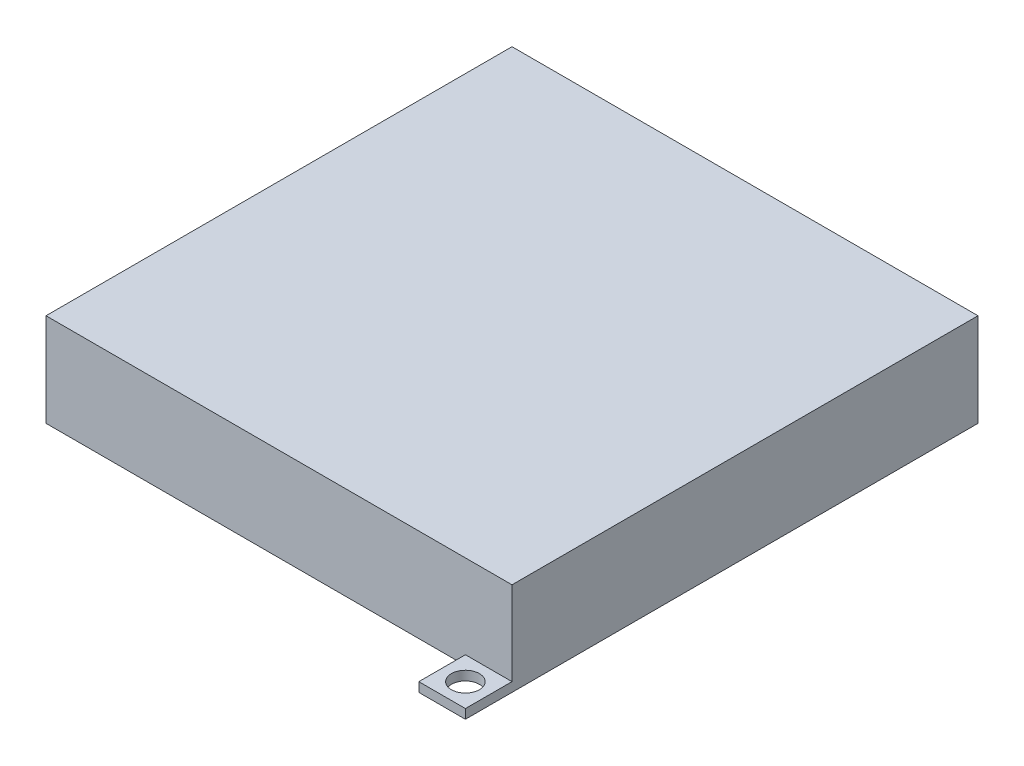
ISO-10303-21;
HEADER;
FILE_DESCRIPTION(('STEP AP214'),'2;1');
FILE_NAME('part.step','',(''),(''),'','','');
FILE_SCHEMA(('AUTOMOTIVE_DESIGN { 1 0 10303 214 1 1 1 1 }'));
ENDSEC;
DATA;
#1=APPLICATION_CONTEXT('core data for automotive mechanical design processes');
#2=APPLICATION_PROTOCOL_DEFINITION('international standard','automotive_design',2000,#1);
#3=PRODUCT_CONTEXT('',#1,'mechanical');
#4=PRODUCT('Part','Part','',(#3));
#5=PRODUCT_RELATED_PRODUCT_CATEGORY('part','',(#4));
#6=PRODUCT_DEFINITION_FORMATION('','',#4);
#7=PRODUCT_DEFINITION_CONTEXT('part definition',#1,'design');
#8=PRODUCT_DEFINITION('design','',#6,#7);
#9=PRODUCT_DEFINITION_SHAPE('','',#8);
#10=(LENGTH_UNIT() NAMED_UNIT(*) SI_UNIT(.MILLI.,.METRE.));
#11=(NAMED_UNIT(*) PLANE_ANGLE_UNIT() SI_UNIT($,.RADIAN.));
#12=(NAMED_UNIT(*) SI_UNIT($,.STERADIAN.) SOLID_ANGLE_UNIT());
#13=UNCERTAINTY_MEASURE_WITH_UNIT(LENGTH_MEASURE(1.E-05),#10,'distance_accuracy_value','');
#14=(GEOMETRIC_REPRESENTATION_CONTEXT(3) GLOBAL_UNCERTAINTY_ASSIGNED_CONTEXT((#13)) GLOBAL_UNIT_ASSIGNED_CONTEXT((#10,
#11,#12)) REPRESENTATION_CONTEXT('',''));
#15=CARTESIAN_POINT('',(0.,0.,0.));
#16=DIRECTION('',(0.,0.,1.));
#17=DIRECTION('',(1.,0.,0.));
#18=AXIS2_PLACEMENT_3D('',#15,#16,#17);
#19=CARTESIAN_POINT('',(25.,10.,25.));
#20=DIRECTION('',(0.,0.,-1.));
#21=DIRECTION('',(-1.,0.,0.));
#22=AXIS2_PLACEMENT_3D('',#19,#20,#21);
#23=PLANE('',#22);
#24=DIRECTION('',(0.,-1.,0.));
#25=VECTOR('',#24,1.);
#26=CARTESIAN_POINT('',(20.,1.,25.));
#27=LINE('',#26,#25);
#28=CARTESIAN_POINT('',(20.,1.,25.));
#29=VERTEX_POINT('',#28);
#30=CARTESIAN_POINT('',(20.,0.,25.));
#31=VERTEX_POINT('',#30);
#32=EDGE_CURVE('E180',#29,#31,#27,.T.);
#33=ORIENTED_EDGE('',*,*,#32,.F.);
#34=DIRECTION('',(1.,0.,0.));
#35=VECTOR('',#34,1.);
#36=CARTESIAN_POINT('',(20.,1.,25.));
#37=LINE('',#36,#35);
#38=CARTESIAN_POINT('',(25.,0.999999999999999,25.));
#39=VERTEX_POINT('',#38);
#40=EDGE_CURVE('E165',#29,#39,#37,.T.);
#41=ORIENTED_EDGE('',*,*,#40,.T.);
#42=DIRECTION('',(0.,-1.,0.));
#43=VECTOR('',#42,1.);
#44=CARTESIAN_POINT('',(25.,10.,25.));
#45=LINE('',#44,#43);
#46=CARTESIAN_POINT('',(25.,10.,25.));
#47=VERTEX_POINT('',#46);
#48=EDGE_CURVE('E163',#47,#39,#45,.T.);
#49=ORIENTED_EDGE('',*,*,#48,.F.);
#50=DIRECTION('',(1.,0.,0.));
#51=VECTOR('',#50,1.);
#52=CARTESIAN_POINT('',(25.,10.,25.));
#53=LINE('',#52,#51);
#54=CARTESIAN_POINT('',(-25.,10.,25.));
#55=VERTEX_POINT('',#54);
#56=EDGE_CURVE('E279',#55,#47,#53,.T.);
#57=ORIENTED_EDGE('',*,*,#56,.F.);
#58=DIRECTION('',(0.,-1.,0.));
#59=VECTOR('',#58,1.);
#60=CARTESIAN_POINT('',(-25.,10.,25.));
#61=LINE('',#60,#59);
#62=CARTESIAN_POINT('',(-25.,0.,25.));
#63=VERTEX_POINT('',#62);
#64=EDGE_CURVE('E296',#55,#63,#61,.T.);
#65=ORIENTED_EDGE('',*,*,#64,.T.);
#66=DIRECTION('',(1.,0.,0.));
#67=VECTOR('',#66,1.);
#68=CARTESIAN_POINT('',(25.,0.,25.));
#69=LINE('',#68,#67);
#70=EDGE_CURVE('E273',#63,#31,#69,.T.);
#71=ORIENTED_EDGE('',*,*,#70,.T.);
#72=EDGE_LOOP('',(#33,#41,#49,#57,#65,#71));
#73=FACE_BOUND('',#72,.T.);
#74=ADVANCED_FACE('F39',(#73),#23,.F.);
#75=CARTESIAN_POINT('',(25.,10.,-25.));
#76=DIRECTION('',(0.,0.,1.));
#77=DIRECTION('',(1.,0.,0.));
#78=AXIS2_PLACEMENT_3D('',#75,#76,#77);
#79=PLANE('',#78);
#80=DIRECTION('',(0.,-1.,0.));
#81=VECTOR('',#80,1.);
#82=CARTESIAN_POINT('',(-20.,1.,-25.));
#83=LINE('',#82,#81);
#84=CARTESIAN_POINT('',(-20.,1.,-25.));
#85=VERTEX_POINT('',#84);
#86=CARTESIAN_POINT('',(-20.,0.,-25.));
#87=VERTEX_POINT('',#86);
#88=EDGE_CURVE('E215',#85,#87,#83,.T.);
#89=ORIENTED_EDGE('',*,*,#88,.F.);
#90=DIRECTION('',(-1.,0.,0.));
#91=VECTOR('',#90,1.);
#92=CARTESIAN_POINT('',(-20.,1.,-25.));
#93=LINE('',#92,#91);
#94=CARTESIAN_POINT('',(-25.,0.999999999999999,-25.));
#95=VERTEX_POINT('',#94);
#96=EDGE_CURVE('E194',#85,#95,#93,.T.);
#97=ORIENTED_EDGE('',*,*,#96,.T.);
#98=DIRECTION('',(0.,-1.,0.));
#99=VECTOR('',#98,1.);
#100=CARTESIAN_POINT('',(-25.,10.,-25.));
#101=LINE('',#100,#99);
#102=CARTESIAN_POINT('',(-25.,10.,-25.));
#103=VERTEX_POINT('',#102);
#104=EDGE_CURVE('E48',#103,#95,#101,.T.);
#105=ORIENTED_EDGE('',*,*,#104,.F.);
#106=DIRECTION('',(-1.,0.,0.));
#107=VECTOR('',#106,1.);
#108=CARTESIAN_POINT('',(25.,10.,-25.));
#109=LINE('',#108,#107);
#110=CARTESIAN_POINT('',(25.,10.,-25.));
#111=VERTEX_POINT('',#110);
#112=EDGE_CURVE('E272',#111,#103,#109,.T.);
#113=ORIENTED_EDGE('',*,*,#112,.F.);
#114=DIRECTION('',(0.,-1.,0.));
#115=VECTOR('',#114,1.);
#116=CARTESIAN_POINT('',(25.,10.,-25.));
#117=LINE('',#116,#115);
#118=CARTESIAN_POINT('',(25.,0.,-25.));
#119=VERTEX_POINT('',#118);
#120=EDGE_CURVE('E11',#111,#119,#117,.T.);
#121=ORIENTED_EDGE('',*,*,#120,.T.);
#122=DIRECTION('',(-1.,0.,0.));
#123=VECTOR('',#122,1.);
#124=CARTESIAN_POINT('',(25.,0.,-25.));
#125=LINE('',#124,#123);
#126=EDGE_CURVE('E284',#119,#87,#125,.T.);
#127=ORIENTED_EDGE('',*,*,#126,.T.);
#128=EDGE_LOOP('',(#89,#97,#105,#113,#121,#127));
#129=FACE_BOUND('',#128,.T.);
#130=ADVANCED_FACE('F308',(#129),#79,.F.);
#131=CARTESIAN_POINT('',(0.,0.,0.));
#132=DIRECTION('',(0.,1.,0.));
#133=DIRECTION('',(0.,0.,1.));
#134=AXIS2_PLACEMENT_3D('',#131,#132,#133);
#135=PLANE('',#134);
#136=DIRECTION('',(0.,0.,-1.));
#137=VECTOR('',#136,1.);
#138=CARTESIAN_POINT('',(25.,0.,25.));
#139=LINE('',#138,#137);
#140=CARTESIAN_POINT('',(25.,0.,30.));
#141=VERTEX_POINT('',#140);
#142=EDGE_CURVE('E267',#141,#119,#139,.T.);
#143=ORIENTED_EDGE('',*,*,#142,.F.);
#144=DIRECTION('',(-1.,0.,0.));
#145=VECTOR('',#144,1.);
#146=CARTESIAN_POINT('',(25.,0.,30.));
#147=LINE('',#146,#145);
#148=CARTESIAN_POINT('',(20.,0.,30.));
#149=VERTEX_POINT('',#148);
#150=EDGE_CURVE('E149',#141,#149,#147,.T.);
#151=ORIENTED_EDGE('',*,*,#150,.T.);
#152=DIRECTION('',(0.,0.,-1.));
#153=VECTOR('',#152,1.);
#154=CARTESIAN_POINT('',(20.,0.,30.));
#155=LINE('',#154,#153);
#156=EDGE_CURVE('E168',#149,#31,#155,.T.);
#157=ORIENTED_EDGE('',*,*,#156,.T.);
#158=ORIENTED_EDGE('',*,*,#70,.F.);
#159=DIRECTION('',(0.,0.,1.));
#160=VECTOR('',#159,1.);
#161=CARTESIAN_POINT('',(-25.,0.,25.));
#162=LINE('',#161,#160);
#163=CARTESIAN_POINT('',(-25.,0.,-30.));
#164=VERTEX_POINT('',#163);
#165=EDGE_CURVE('E288',#164,#63,#162,.T.);
#166=ORIENTED_EDGE('',*,*,#165,.F.);
#167=DIRECTION('',(1.,0.,0.));
#168=VECTOR('',#167,1.);
#169=CARTESIAN_POINT('',(-25.,0.,-30.));
#170=LINE('',#169,#168);
#171=CARTESIAN_POINT('',(-20.,0.,-30.));
#172=VERTEX_POINT('',#171);
#173=EDGE_CURVE('E190',#164,#172,#170,.T.);
#174=ORIENTED_EDGE('',*,*,#173,.T.);
#175=DIRECTION('',(0.,0.,1.));
#176=VECTOR('',#175,1.);
#177=CARTESIAN_POINT('',(-20.,0.,-30.));
#178=LINE('',#177,#176);
#179=EDGE_CURVE('E197',#172,#87,#178,.T.);
#180=ORIENTED_EDGE('',*,*,#179,.T.);
#181=ORIENTED_EDGE('',*,*,#126,.F.);
#182=EDGE_LOOP('',(#143,#151,#157,#158,#166,#174,#180,#181));
#183=FACE_BOUND('',#182,.T.);
#184=DIRECTION('',(0.,0.,1.));
#185=VECTOR('',#184,1.);
#186=CARTESIAN_POINT('',(-20.,0.,20.));
#187=LINE('',#186,#185);
#188=CARTESIAN_POINT('',(-20.,0.,-20.));
#189=VERTEX_POINT('',#188);
#190=CARTESIAN_POINT('',(-20.,0.,20.));
#191=VERTEX_POINT('',#190);
#192=EDGE_CURVE('E218',#189,#191,#187,.T.);
#193=ORIENTED_EDGE('',*,*,#192,.T.);
#194=DIRECTION('',(1.,0.,0.));
#195=VECTOR('',#194,1.);
#196=CARTESIAN_POINT('',(-20.,0.,20.));
#197=LINE('',#196,#195);
#198=CARTESIAN_POINT('',(20.,0.,20.));
#199=VERTEX_POINT('',#198);
#200=EDGE_CURVE('E243',#191,#199,#197,.T.);
#201=ORIENTED_EDGE('',*,*,#200,.T.);
#202=DIRECTION('',(0.,0.,-1.));
#203=VECTOR('',#202,1.);
#204=CARTESIAN_POINT('',(20.,0.,20.));
#205=LINE('',#204,#203);
#206=CARTESIAN_POINT('',(20.,0.,-20.));
#207=VERTEX_POINT('',#206);
#208=EDGE_CURVE('E247',#199,#207,#205,.T.);
#209=ORIENTED_EDGE('',*,*,#208,.T.);
#210=DIRECTION('',(-1.,0.,0.));
#211=VECTOR('',#210,1.);
#212=CARTESIAN_POINT('',(-20.,0.,-20.));
#213=LINE('',#212,#211);
#214=EDGE_CURVE('E230',#207,#189,#213,.T.);
#215=ORIENTED_EDGE('',*,*,#214,.T.);
#216=EDGE_LOOP('',(#193,#201,#209,#215));
#217=FACE_BOUND('',#216,.T.);
#218=CARTESIAN_POINT('',(-22.5,0.,-27.5));
#219=DIRECTION('',(0.,-1.,0.));
#220=DIRECTION('',(0.,0.,-1.));
#221=AXIS2_PLACEMENT_3D('',#218,#219,#220);
#222=CIRCLE('',#221,1.5);
#223=CARTESIAN_POINT('',(-22.5,0.,-29.));
#224=VERTEX_POINT('',#223);
#225=EDGE_CURVE('E183',#224,#224,#222,.T.);
#226=ORIENTED_EDGE('',*,*,#225,.F.);
#227=EDGE_LOOP('',(#226));
#228=FACE_BOUND('',#227,.T.);
#229=CARTESIAN_POINT('',(22.5,0.,27.5));
#230=DIRECTION('',(0.,-1.,0.));
#231=DIRECTION('',(0.,0.,-1.));
#232=AXIS2_PLACEMENT_3D('',#229,#230,#231);
#233=CIRCLE('',#232,1.5);
#234=CARTESIAN_POINT('',(22.5,0.,26.));
#235=VERTEX_POINT('',#234);
#236=EDGE_CURVE('E465',#235,#235,#233,.T.);
#237=ORIENTED_EDGE('',*,*,#236,.F.);
#238=EDGE_LOOP('',(#237));
#239=FACE_BOUND('',#238,.T.);
#240=ADVANCED_FACE('F322',(#183,#217,#228,#239),#135,.F.);
#241=CARTESIAN_POINT('',(25.,10.,25.));
#242=DIRECTION('',(-1.,0.,0.));
#243=DIRECTION('',(0.,0.,1.));
#244=AXIS2_PLACEMENT_3D('',#241,#242,#243);
#245=PLANE('',#244);
#246=ORIENTED_EDGE('',*,*,#142,.T.);
#247=ORIENTED_EDGE('',*,*,#120,.F.);
#248=DIRECTION('',(0.,0.,-1.));
#249=VECTOR('',#248,1.);
#250=CARTESIAN_POINT('',(25.,10.,25.));
#251=LINE('',#250,#249);
#252=EDGE_CURVE('E268',#47,#111,#251,.T.);
#253=ORIENTED_EDGE('',*,*,#252,.F.);
#254=ORIENTED_EDGE('',*,*,#48,.T.);
#255=DIRECTION('',(0.,0.,1.));
#256=VECTOR('',#255,1.);
#257=CARTESIAN_POINT('',(25.,1.,25.));
#258=LINE('',#257,#256);
#259=CARTESIAN_POINT('',(25.,1.,30.));
#260=VERTEX_POINT('',#259);
#261=EDGE_CURVE('E55',#39,#260,#258,.T.);
#262=ORIENTED_EDGE('',*,*,#261,.T.);
#263=DIRECTION('',(0.,-1.,0.));
#264=VECTOR('',#263,1.);
#265=CARTESIAN_POINT('',(25.,1.,30.));
#266=LINE('',#265,#264);
#267=EDGE_CURVE('E144',#260,#141,#266,.T.);
#268=ORIENTED_EDGE('',*,*,#267,.T.);
#269=EDGE_LOOP('',(#246,#247,#253,#254,#262,#268));
#270=FACE_BOUND('',#269,.T.);
#271=ADVANCED_FACE('F41',(#270),#245,.F.);
#272=CARTESIAN_POINT('',(-25.,10.,25.));
#273=DIRECTION('',(1.,0.,0.));
#274=DIRECTION('',(0.,0.,-1.));
#275=AXIS2_PLACEMENT_3D('',#272,#273,#274);
#276=PLANE('',#275);
#277=ORIENTED_EDGE('',*,*,#165,.T.);
#278=ORIENTED_EDGE('',*,*,#64,.F.);
#279=DIRECTION('',(0.,0.,1.));
#280=VECTOR('',#279,1.);
#281=CARTESIAN_POINT('',(-25.,10.,25.));
#282=LINE('',#281,#280);
#283=EDGE_CURVE('E276',#103,#55,#282,.T.);
#284=ORIENTED_EDGE('',*,*,#283,.F.);
#285=ORIENTED_EDGE('',*,*,#104,.T.);
#286=DIRECTION('',(0.,0.,-1.));
#287=VECTOR('',#286,1.);
#288=CARTESIAN_POINT('',(-25.,1.,-25.));
#289=LINE('',#288,#287);
#290=CARTESIAN_POINT('',(-25.,1.,-30.));
#291=VERTEX_POINT('',#290);
#292=EDGE_CURVE('E63',#95,#291,#289,.T.);
#293=ORIENTED_EDGE('',*,*,#292,.T.);
#294=DIRECTION('',(0.,-1.,0.));
#295=VECTOR('',#294,1.);
#296=CARTESIAN_POINT('',(-25.,1.,-30.));
#297=LINE('',#296,#295);
#298=EDGE_CURVE('E208',#291,#164,#297,.T.);
#299=ORIENTED_EDGE('',*,*,#298,.T.);
#300=EDGE_LOOP('',(#277,#278,#284,#285,#293,#299));
#301=FACE_BOUND('',#300,.T.);
#302=ADVANCED_FACE('F304',(#301),#276,.F.);
#303=CARTESIAN_POINT('',(0.,10.,0.));
#304=DIRECTION('',(0.,1.,0.));
#305=DIRECTION('',(0.,0.,1.));
#306=AXIS2_PLACEMENT_3D('',#303,#304,#305);
#307=PLANE('',#306);
#308=ORIENTED_EDGE('',*,*,#252,.T.);
#309=ORIENTED_EDGE('',*,*,#112,.T.);
#310=ORIENTED_EDGE('',*,*,#283,.T.);
#311=ORIENTED_EDGE('',*,*,#56,.T.);
#312=EDGE_LOOP('',(#308,#309,#310,#311));
#313=FACE_BOUND('',#312,.T.);
#314=ADVANCED_FACE('F329',(#313),#307,.T.);
#315=CARTESIAN_POINT('',(-20.,7.,20.));
#316=DIRECTION('',(1.,0.,0.));
#317=DIRECTION('',(0.,0.,-1.));
#318=AXIS2_PLACEMENT_3D('',#315,#316,#317);
#319=PLANE('',#318);
#320=ORIENTED_EDGE('',*,*,#192,.F.);
#321=DIRECTION('',(0.,-1.,0.));
#322=VECTOR('',#321,1.);
#323=CARTESIAN_POINT('',(-20.,7.,-20.));
#324=LINE('',#323,#322);
#325=CARTESIAN_POINT('',(-20.,7.,-20.));
#326=VERTEX_POINT('',#325);
#327=EDGE_CURVE('E239',#326,#189,#324,.T.);
#328=ORIENTED_EDGE('',*,*,#327,.F.);
#329=DIRECTION('',(0.,0.,1.));
#330=VECTOR('',#329,1.);
#331=CARTESIAN_POINT('',(-20.,7.,20.));
#332=LINE('',#331,#330);
#333=CARTESIAN_POINT('',(-20.,7.,20.));
#334=VERTEX_POINT('',#333);
#335=EDGE_CURVE('E225',#326,#334,#332,.T.);
#336=ORIENTED_EDGE('',*,*,#335,.T.);
#337=DIRECTION('',(0.,-1.,0.));
#338=VECTOR('',#337,1.);
#339=CARTESIAN_POINT('',(-20.,7.,20.));
#340=LINE('',#339,#338);
#341=EDGE_CURVE('E263',#334,#191,#340,.T.);
#342=ORIENTED_EDGE('',*,*,#341,.T.);
#343=EDGE_LOOP('',(#320,#328,#336,#342));
#344=FACE_BOUND('',#343,.T.);
#345=ADVANCED_FACE('F331',(#344),#319,.T.);
#346=CARTESIAN_POINT('',(-20.,7.,20.));
#347=DIRECTION('',(0.,0.,-1.));
#348=DIRECTION('',(-1.,0.,0.));
#349=AXIS2_PLACEMENT_3D('',#346,#347,#348);
#350=PLANE('',#349);
#351=ORIENTED_EDGE('',*,*,#200,.F.);
#352=ORIENTED_EDGE('',*,*,#341,.F.);
#353=DIRECTION('',(1.,0.,0.));
#354=VECTOR('',#353,1.);
#355=CARTESIAN_POINT('',(-20.,7.,20.));
#356=LINE('',#355,#354);
#357=CARTESIAN_POINT('',(20.,7.,20.));
#358=VERTEX_POINT('',#357);
#359=EDGE_CURVE('E229',#334,#358,#356,.T.);
#360=ORIENTED_EDGE('',*,*,#359,.T.);
#361=DIRECTION('',(0.,-1.,0.));
#362=VECTOR('',#361,1.);
#363=CARTESIAN_POINT('',(20.,7.,20.));
#364=LINE('',#363,#362);
#365=EDGE_CURVE('E260',#358,#199,#364,.T.);
#366=ORIENTED_EDGE('',*,*,#365,.T.);
#367=EDGE_LOOP('',(#351,#352,#360,#366));
#368=FACE_BOUND('',#367,.T.);
#369=ADVANCED_FACE('F337',(#368),#350,.T.);
#370=CARTESIAN_POINT('',(20.,7.,20.));
#371=DIRECTION('',(-1.,0.,0.));
#372=DIRECTION('',(0.,0.,1.));
#373=AXIS2_PLACEMENT_3D('',#370,#371,#372);
#374=PLANE('',#373);
#375=ORIENTED_EDGE('',*,*,#208,.F.);
#376=ORIENTED_EDGE('',*,*,#365,.F.);
#377=DIRECTION('',(0.,0.,-1.));
#378=VECTOR('',#377,1.);
#379=CARTESIAN_POINT('',(20.,7.,20.));
#380=LINE('',#379,#378);
#381=CARTESIAN_POINT('',(20.,7.,-20.));
#382=VERTEX_POINT('',#381);
#383=EDGE_CURVE('E233',#358,#382,#380,.T.);
#384=ORIENTED_EDGE('',*,*,#383,.T.);
#385=DIRECTION('',(0.,-1.,0.));
#386=VECTOR('',#385,1.);
#387=CARTESIAN_POINT('',(20.,7.,-20.));
#388=LINE('',#387,#386);
#389=EDGE_CURVE('E257',#382,#207,#388,.T.);
#390=ORIENTED_EDGE('',*,*,#389,.T.);
#391=EDGE_LOOP('',(#375,#376,#384,#390));
#392=FACE_BOUND('',#391,.T.);
#393=ADVANCED_FACE('F442',(#392),#374,.T.);
#394=CARTESIAN_POINT('',(-20.,7.,-20.));
#395=DIRECTION('',(0.,0.,1.));
#396=DIRECTION('',(1.,0.,0.));
#397=AXIS2_PLACEMENT_3D('',#394,#395,#396);
#398=PLANE('',#397);
#399=ORIENTED_EDGE('',*,*,#214,.F.);
#400=ORIENTED_EDGE('',*,*,#389,.F.);
#401=DIRECTION('',(-1.,0.,0.));
#402=VECTOR('',#401,1.);
#403=CARTESIAN_POINT('',(-20.,7.,-20.));
#404=LINE('',#403,#402);
#405=EDGE_CURVE('E236',#382,#326,#404,.T.);
#406=ORIENTED_EDGE('',*,*,#405,.T.);
#407=ORIENTED_EDGE('',*,*,#327,.T.);
#408=EDGE_LOOP('',(#399,#400,#406,#407));
#409=FACE_BOUND('',#408,.T.);
#410=ADVANCED_FACE('F438',(#409),#398,.T.);
#411=CARTESIAN_POINT('',(0.,7.,0.));
#412=DIRECTION('',(0.,-1.,0.));
#413=DIRECTION('',(0.,0.,-1.));
#414=AXIS2_PLACEMENT_3D('',#411,#412,#413);
#415=PLANE('',#414);
#416=ORIENTED_EDGE('',*,*,#335,.F.);
#417=ORIENTED_EDGE('',*,*,#405,.F.);
#418=ORIENTED_EDGE('',*,*,#383,.F.);
#419=ORIENTED_EDGE('',*,*,#359,.F.);
#420=EDGE_LOOP('',(#416,#417,#418,#419));
#421=FACE_BOUND('',#420,.T.);
#422=ADVANCED_FACE('F367',(#421),#415,.T.);
#423=CARTESIAN_POINT('',(-20.,1.,-30.));
#424=DIRECTION('',(1.,0.,0.));
#425=DIRECTION('',(0.,0.,-1.));
#426=AXIS2_PLACEMENT_3D('',#423,#424,#425);
#427=PLANE('',#426);
#428=ORIENTED_EDGE('',*,*,#179,.F.);
#429=DIRECTION('',(0.,-1.,0.));
#430=VECTOR('',#429,1.);
#431=CARTESIAN_POINT('',(-20.,1.,-30.));
#432=LINE('',#431,#430);
#433=CARTESIAN_POINT('',(-20.,1.,-30.));
#434=VERTEX_POINT('',#433);
#435=EDGE_CURVE('E219',#434,#172,#432,.T.);
#436=ORIENTED_EDGE('',*,*,#435,.F.);
#437=DIRECTION('',(0.,0.,1.));
#438=VECTOR('',#437,1.);
#439=CARTESIAN_POINT('',(-20.,1.,-30.));
#440=LINE('',#439,#438);
#441=EDGE_CURVE('E204',#434,#85,#440,.T.);
#442=ORIENTED_EDGE('',*,*,#441,.T.);
#443=ORIENTED_EDGE('',*,*,#88,.T.);
#444=EDGE_LOOP('',(#428,#436,#442,#443));
#445=FACE_BOUND('',#444,.T.);
#446=ADVANCED_FACE('F313',(#445),#427,.T.);
#447=CARTESIAN_POINT('',(-25.,1.,-30.));
#448=DIRECTION('',(0.,0.,-1.));
#449=DIRECTION('',(-1.,0.,0.));
#450=AXIS2_PLACEMENT_3D('',#447,#448,#449);
#451=PLANE('',#450);
#452=ORIENTED_EDGE('',*,*,#173,.F.);
#453=ORIENTED_EDGE('',*,*,#298,.F.);
#454=DIRECTION('',(1.,0.,0.));
#455=VECTOR('',#454,1.);
#456=CARTESIAN_POINT('',(-25.,1.,-30.));
#457=LINE('',#456,#455);
#458=EDGE_CURVE('E200',#291,#434,#457,.T.);
#459=ORIENTED_EDGE('',*,*,#458,.T.);
#460=ORIENTED_EDGE('',*,*,#435,.T.);
#461=EDGE_LOOP('',(#452,#453,#459,#460));
#462=FACE_BOUND('',#461,.T.);
#463=ADVANCED_FACE('F316',(#462),#451,.T.);
#464=CARTESIAN_POINT('',(0.,1.,0.));
#465=DIRECTION('',(0.,-1.,0.));
#466=DIRECTION('',(0.,0.,-1.));
#467=AXIS2_PLACEMENT_3D('',#464,#465,#466);
#468=PLANE('',#467);
#469=CARTESIAN_POINT('',(-22.5,1.,-27.5));
#470=DIRECTION('',(0.,-1.,0.));
#471=DIRECTION('',(0.,0.,-1.));
#472=AXIS2_PLACEMENT_3D('',#469,#470,#471);
#473=CIRCLE('',#472,1.5);
#474=CARTESIAN_POINT('',(-22.5,1.,-29.));
#475=VERTEX_POINT('',#474);
#476=EDGE_CURVE('E186',#475,#475,#473,.T.);
#477=ORIENTED_EDGE('',*,*,#476,.T.);
#478=EDGE_LOOP('',(#477));
#479=FACE_BOUND('',#478,.T.);
#480=ORIENTED_EDGE('',*,*,#96,.F.);
#481=ORIENTED_EDGE('',*,*,#441,.F.);
#482=ORIENTED_EDGE('',*,*,#458,.F.);
#483=ORIENTED_EDGE('',*,*,#292,.F.);
#484=EDGE_LOOP('',(#480,#481,#482,#483));
#485=FACE_BOUND('',#484,.T.);
#486=ADVANCED_FACE('F310',(#479,#485),#468,.F.);
#487=CARTESIAN_POINT('',(-22.5,1.,-27.5));
#488=DIRECTION('',(0.,-1.,0.));
#489=DIRECTION('',(0.,0.,-1.));
#490=AXIS2_PLACEMENT_3D('',#487,#488,#489);
#491=CYLINDRICAL_SURFACE('',#490,1.5);
#492=ORIENTED_EDGE('',*,*,#476,.F.);
#493=EDGE_LOOP('',(#492));
#494=FACE_BOUND('',#493,.T.);
#495=ORIENTED_EDGE('',*,*,#225,.T.);
#496=EDGE_LOOP('',(#495));
#497=FACE_BOUND('',#496,.T.);
#498=ADVANCED_FACE('F385',(#494,#497),#491,.F.);
#499=CARTESIAN_POINT('',(20.,1.,30.));
#500=DIRECTION('',(-1.,0.,0.));
#501=DIRECTION('',(0.,0.,1.));
#502=AXIS2_PLACEMENT_3D('',#499,#500,#501);
#503=PLANE('',#502);
#504=ORIENTED_EDGE('',*,*,#156,.F.);
#505=DIRECTION('',(0.,-1.,0.));
#506=VECTOR('',#505,1.);
#507=CARTESIAN_POINT('',(20.,1.,30.));
#508=LINE('',#507,#506);
#509=CARTESIAN_POINT('',(20.,1.,30.));
#510=VERTEX_POINT('',#509);
#511=EDGE_CURVE('E153',#510,#149,#508,.T.);
#512=ORIENTED_EDGE('',*,*,#511,.F.);
#513=DIRECTION('',(0.,0.,-1.));
#514=VECTOR('',#513,1.);
#515=CARTESIAN_POINT('',(20.,1.,30.));
#516=LINE('',#515,#514);
#517=EDGE_CURVE('E154',#510,#29,#516,.T.);
#518=ORIENTED_EDGE('',*,*,#517,.T.);
#519=ORIENTED_EDGE('',*,*,#32,.T.);
#520=EDGE_LOOP('',(#504,#512,#518,#519));
#521=FACE_BOUND('',#520,.T.);
#522=ADVANCED_FACE('F326',(#521),#503,.T.);
#523=CARTESIAN_POINT('',(25.,1.,30.));
#524=DIRECTION('',(0.,0.,1.));
#525=DIRECTION('',(1.,0.,0.));
#526=AXIS2_PLACEMENT_3D('',#523,#524,#525);
#527=PLANE('',#526);
#528=ORIENTED_EDGE('',*,*,#150,.F.);
#529=ORIENTED_EDGE('',*,*,#267,.F.);
#530=DIRECTION('',(-1.,0.,0.));
#531=VECTOR('',#530,1.);
#532=CARTESIAN_POINT('',(25.,1.,30.));
#533=LINE('',#532,#531);
#534=EDGE_CURVE('E146',#260,#510,#533,.T.);
#535=ORIENTED_EDGE('',*,*,#534,.T.);
#536=ORIENTED_EDGE('',*,*,#511,.T.);
#537=EDGE_LOOP('',(#528,#529,#535,#536));
#538=FACE_BOUND('',#537,.T.);
#539=ADVANCED_FACE('F145',(#538),#527,.T.);
#540=CARTESIAN_POINT('',(0.,1.,0.));
#541=DIRECTION('',(0.,-1.,0.));
#542=DIRECTION('',(0.,0.,-1.));
#543=AXIS2_PLACEMENT_3D('',#540,#541,#542);
#544=PLANE('',#543);
#545=CARTESIAN_POINT('',(22.5,1.,27.5));
#546=DIRECTION('',(0.,-1.,0.));
#547=DIRECTION('',(0.,0.,-1.));
#548=AXIS2_PLACEMENT_3D('',#545,#546,#547);
#549=CIRCLE('',#548,1.5);
#550=CARTESIAN_POINT('',(22.5,1.,26.));
#551=VERTEX_POINT('',#550);
#552=EDGE_CURVE('E176',#551,#551,#549,.T.);
#553=ORIENTED_EDGE('',*,*,#552,.T.);
#554=EDGE_LOOP('',(#553));
#555=FACE_BOUND('',#554,.T.);
#556=ORIENTED_EDGE('',*,*,#40,.F.);
#557=ORIENTED_EDGE('',*,*,#517,.F.);
#558=ORIENTED_EDGE('',*,*,#534,.F.);
#559=ORIENTED_EDGE('',*,*,#261,.F.);
#560=EDGE_LOOP('',(#556,#557,#558,#559));
#561=FACE_BOUND('',#560,.T.);
#562=ADVANCED_FACE('F156',(#555,#561),#544,.F.);
#563=CARTESIAN_POINT('',(22.5,1.,27.5));
#564=DIRECTION('',(0.,-1.,0.));
#565=DIRECTION('',(0.,0.,-1.));
#566=AXIS2_PLACEMENT_3D('',#563,#564,#565);
#567=CYLINDRICAL_SURFACE('',#566,1.5);
#568=ORIENTED_EDGE('',*,*,#552,.F.);
#569=EDGE_LOOP('',(#568));
#570=FACE_BOUND('',#569,.T.);
#571=ORIENTED_EDGE('',*,*,#236,.T.);
#572=EDGE_LOOP('',(#571));
#573=FACE_BOUND('',#572,.T.);
#574=ADVANCED_FACE('F420',(#570,#573),#567,.F.);
#575=CLOSED_SHELL('',(#74,#130,#240,#271,#302,#314,#345,#369,#393,#410,#422,#446,#463,#486,#498,
#522,#539,#562,#574));
#576=MANIFOLD_SOLID_BREP('B2',#575);
#577=ADVANCED_BREP_SHAPE_REPRESENTATION('',(#18,#576),#14);
#578=SHAPE_DEFINITION_REPRESENTATION(#9,#577);
ENDSEC;
END-ISO-10303-21;
